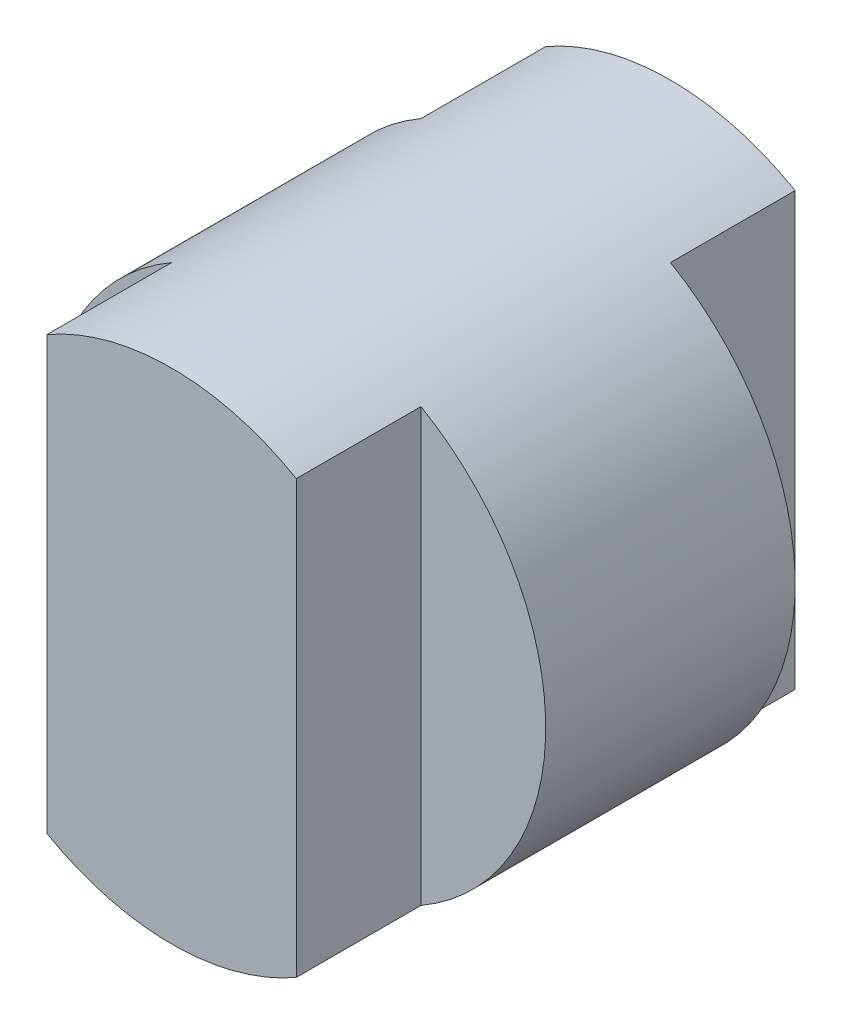
ISO-10303-21;
HEADER;
FILE_DESCRIPTION(('STEP AP214'),'2;1');
FILE_NAME('part.step','',(''),(''),'','','');
FILE_SCHEMA(('AUTOMOTIVE_DESIGN { 1 0 10303 214 1 1 1 1 }'));
ENDSEC;
DATA;
#1=APPLICATION_CONTEXT('core data for automotive mechanical design processes');
#2=APPLICATION_PROTOCOL_DEFINITION('international standard','automotive_design',2000,#1);
#3=PRODUCT_CONTEXT('',#1,'mechanical');
#4=PRODUCT('Part','Part','',(#3));
#5=PRODUCT_RELATED_PRODUCT_CATEGORY('part','',(#4));
#6=PRODUCT_DEFINITION_FORMATION('','',#4);
#7=PRODUCT_DEFINITION_CONTEXT('part definition',#1,'design');
#8=PRODUCT_DEFINITION('design','',#6,#7);
#9=PRODUCT_DEFINITION_SHAPE('','',#8);
#10=(LENGTH_UNIT() NAMED_UNIT(*) SI_UNIT(.MILLI.,.METRE.));
#11=(NAMED_UNIT(*) PLANE_ANGLE_UNIT() SI_UNIT($,.RADIAN.));
#12=(NAMED_UNIT(*) SI_UNIT($,.STERADIAN.) SOLID_ANGLE_UNIT());
#13=UNCERTAINTY_MEASURE_WITH_UNIT(LENGTH_MEASURE(1.E-05),#10,'distance_accuracy_value','');
#14=(GEOMETRIC_REPRESENTATION_CONTEXT(3) GLOBAL_UNCERTAINTY_ASSIGNED_CONTEXT((#13)) GLOBAL_UNIT_ASSIGNED_CONTEXT((#10,
#11,#12)) REPRESENTATION_CONTEXT('',''));
#15=CARTESIAN_POINT('',(0.,0.,0.));
#16=DIRECTION('',(0.,0.,1.));
#17=DIRECTION('',(1.,0.,0.));
#18=AXIS2_PLACEMENT_3D('',#15,#16,#17);
#19=CARTESIAN_POINT('',(0.,0.,4.));
#20=DIRECTION('',(0.,0.,-1.));
#21=DIRECTION('',(-1.,0.,0.));
#22=AXIS2_PLACEMENT_3D('',#19,#20,#21);
#23=CYLINDRICAL_SURFACE('',#22,2.);
#24=CARTESIAN_POINT('',(0.,0.,4.));
#25=DIRECTION('',(0.,0.,1.));
#26=DIRECTION('',(1.,0.,0.));
#27=AXIS2_PLACEMENT_3D('',#24,#25,#26);
#28=CIRCLE('',#27,2.);
#29=CARTESIAN_POINT('',(-1.,-1.73205080756888,4.));
#30=VERTEX_POINT('',#29);
#31=CARTESIAN_POINT('',(1.,-1.73205080756888,4.));
#32=VERTEX_POINT('',#31);
#33=EDGE_CURVE('E116',#30,#32,#28,.T.);
#34=ORIENTED_EDGE('',*,*,#33,.F.);
#35=DIRECTION('',(0.,0.,-1.));
#36=VECTOR('',#35,1.);
#37=CARTESIAN_POINT('',(-1.,-1.73205080756888,4.));
#38=LINE('',#37,#36);
#39=CARTESIAN_POINT('',(-1.,-1.73205080756888,3.));
#40=VERTEX_POINT('',#39);
#41=EDGE_CURVE('E55',#30,#40,#38,.T.);
#42=ORIENTED_EDGE('',*,*,#41,.T.);
#43=CARTESIAN_POINT('',(0.,0.,3.));
#44=DIRECTION('',(0.,0.,-1.));
#45=DIRECTION('',(-1.,0.,0.));
#46=AXIS2_PLACEMENT_3D('',#43,#44,#45);
#47=CIRCLE('',#46,2.);
#48=CARTESIAN_POINT('',(-1.,1.73205080756888,3.));
#49=VERTEX_POINT('',#48);
#50=EDGE_CURVE('E130',#40,#49,#47,.T.);
#51=ORIENTED_EDGE('',*,*,#50,.T.);
#52=DIRECTION('',(0.,0.,-1.));
#53=VECTOR('',#52,1.);
#54=CARTESIAN_POINT('',(-1.,1.73205080756888,4.));
#55=LINE('',#54,#53);
#56=CARTESIAN_POINT('',(-1.,1.73205080756888,4.));
#57=VERTEX_POINT('',#56);
#58=EDGE_CURVE('E117',#49,#57,#55,.F.);
#59=ORIENTED_EDGE('',*,*,#58,.T.);
#60=CARTESIAN_POINT('',(1.,1.73205080756888,4.));
#61=VERTEX_POINT('',#60);
#62=EDGE_CURVE('E121',#61,#57,#28,.T.);
#63=ORIENTED_EDGE('',*,*,#62,.F.);
#64=DIRECTION('',(0.,0.,-1.));
#65=VECTOR('',#64,1.);
#66=CARTESIAN_POINT('',(1.,1.73205080756888,4.));
#67=LINE('',#66,#65);
#68=CARTESIAN_POINT('',(1.,1.73205080756888,3.));
#69=VERTEX_POINT('',#68);
#70=EDGE_CURVE('E157',#61,#69,#67,.T.);
#71=ORIENTED_EDGE('',*,*,#70,.T.);
#72=CARTESIAN_POINT('',(0.,0.,3.));
#73=DIRECTION('',(0.,0.,-1.));
#74=DIRECTION('',(-1.,0.,0.));
#75=AXIS2_PLACEMENT_3D('',#72,#73,#74);
#76=CIRCLE('',#75,2.);
#77=CARTESIAN_POINT('',(1.,-1.73205080756888,3.));
#78=VERTEX_POINT('',#77);
#79=EDGE_CURVE('E127',#69,#78,#76,.T.);
#80=ORIENTED_EDGE('',*,*,#79,.T.);
#81=DIRECTION('',(0.,0.,-1.));
#82=VECTOR('',#81,1.);
#83=CARTESIAN_POINT('',(1.,-1.73205080756888,4.));
#84=LINE('',#83,#82);
#85=EDGE_CURVE('E154',#78,#32,#84,.F.);
#86=ORIENTED_EDGE('',*,*,#85,.T.);
#87=EDGE_LOOP('',(#34,#42,#51,#59,#63,#71,#80,#86));
#88=FACE_BOUND('',#87,.T.);
#89=CARTESIAN_POINT('',(0.,0.,1.));
#90=DIRECTION('',(0.,0.,1.));
#91=DIRECTION('',(1.,0.,0.));
#92=AXIS2_PLACEMENT_3D('',#89,#90,#91);
#93=CIRCLE('',#92,2.);
#94=CARTESIAN_POINT('',(1.,-1.73205080756888,1.));
#95=VERTEX_POINT('',#94);
#96=CARTESIAN_POINT('',(1.,1.73205080756888,1.));
#97=VERTEX_POINT('',#96);
#98=EDGE_CURVE('E11',#95,#97,#93,.T.);
#99=ORIENTED_EDGE('',*,*,#98,.T.);
#100=DIRECTION('',(0.,0.,-1.));
#101=VECTOR('',#100,1.);
#102=CARTESIAN_POINT('',(1.,1.73205080756888,4.));
#103=LINE('',#102,#101);
#104=CARTESIAN_POINT('',(1.,1.73205080756888,0.));
#105=VERTEX_POINT('',#104);
#106=EDGE_CURVE('E98',#97,#105,#103,.T.);
#107=ORIENTED_EDGE('',*,*,#106,.T.);
#108=CARTESIAN_POINT('',(0.,0.,0.));
#109=DIRECTION('',(0.,0.,1.));
#110=DIRECTION('',(1.,0.,0.));
#111=AXIS2_PLACEMENT_3D('',#108,#109,#110);
#112=CIRCLE('',#111,2.);
#113=CARTESIAN_POINT('',(-1.,1.73205080756888,0.));
#114=VERTEX_POINT('',#113);
#115=EDGE_CURVE('E107',#105,#114,#112,.T.);
#116=ORIENTED_EDGE('',*,*,#115,.T.);
#117=DIRECTION('',(0.,0.,-1.));
#118=VECTOR('',#117,1.);
#119=CARTESIAN_POINT('',(-1.,1.73205080756888,4.));
#120=LINE('',#119,#118);
#121=CARTESIAN_POINT('',(-1.,1.73205080756888,1.));
#122=VERTEX_POINT('',#121);
#123=EDGE_CURVE('E136',#114,#122,#120,.F.);
#124=ORIENTED_EDGE('',*,*,#123,.T.);
#125=CARTESIAN_POINT('',(0.,0.,1.));
#126=DIRECTION('',(0.,0.,1.));
#127=DIRECTION('',(1.,0.,0.));
#128=AXIS2_PLACEMENT_3D('',#125,#126,#127);
#129=CIRCLE('',#128,2.);
#130=CARTESIAN_POINT('',(-1.,-1.73205080756888,1.));
#131=VERTEX_POINT('',#130);
#132=EDGE_CURVE('E104',#122,#131,#129,.T.);
#133=ORIENTED_EDGE('',*,*,#132,.T.);
#134=DIRECTION('',(0.,0.,-1.));
#135=VECTOR('',#134,1.);
#136=CARTESIAN_POINT('',(-1.,-1.73205080756888,4.));
#137=LINE('',#136,#135);
#138=CARTESIAN_POINT('',(-1.,-1.73205080756888,0.));
#139=VERTEX_POINT('',#138);
#140=EDGE_CURVE('E135',#131,#139,#137,.T.);
#141=ORIENTED_EDGE('',*,*,#140,.T.);
#142=CARTESIAN_POINT('',(1.,-1.73205080756888,0.));
#143=VERTEX_POINT('',#142);
#144=EDGE_CURVE('E114',#139,#143,#112,.T.);
#145=ORIENTED_EDGE('',*,*,#144,.T.);
#146=DIRECTION('',(0.,0.,-1.));
#147=VECTOR('',#146,1.);
#148=CARTESIAN_POINT('',(1.,-1.73205080756888,4.));
#149=LINE('',#148,#147);
#150=EDGE_CURVE('E47',#143,#95,#149,.F.);
#151=ORIENTED_EDGE('',*,*,#150,.T.);
#152=EDGE_LOOP('',(#99,#107,#116,#124,#133,#141,#145,#151));
#153=FACE_BOUND('',#152,.T.);
#154=ADVANCED_FACE('F33',(#88,#153),#23,.T.);
#155=CARTESIAN_POINT('',(0.,0.,4.));
#156=DIRECTION('',(0.,0.,1.));
#157=DIRECTION('',(1.,0.,0.));
#158=AXIS2_PLACEMENT_3D('',#155,#156,#157);
#159=PLANE('',#158);
#160=DIRECTION('',(0.,1.,0.));
#161=VECTOR('',#160,1.);
#162=CARTESIAN_POINT('',(-1.,0.,4.));
#163=LINE('',#162,#161);
#164=EDGE_CURVE('E125',#30,#57,#163,.T.);
#165=ORIENTED_EDGE('',*,*,#164,.F.);
#166=ORIENTED_EDGE('',*,*,#33,.T.);
#167=DIRECTION('',(0.,-1.,0.));
#168=VECTOR('',#167,1.);
#169=CARTESIAN_POINT('',(1.,0.,4.));
#170=LINE('',#169,#168);
#171=EDGE_CURVE('E123',#61,#32,#170,.T.);
#172=ORIENTED_EDGE('',*,*,#171,.F.);
#173=ORIENTED_EDGE('',*,*,#62,.T.);
#174=EDGE_LOOP('',(#165,#166,#172,#173));
#175=FACE_BOUND('',#174,.T.);
#176=ADVANCED_FACE('F167',(#175),#159,.T.);
#177=CARTESIAN_POINT('',(0.,0.,0.));
#178=DIRECTION('',(0.,0.,1.));
#179=DIRECTION('',(1.,0.,0.));
#180=AXIS2_PLACEMENT_3D('',#177,#178,#179);
#181=PLANE('',#180);
#182=ORIENTED_EDGE('',*,*,#115,.F.);
#183=DIRECTION('',(0.,-1.,0.));
#184=VECTOR('',#183,1.);
#185=CARTESIAN_POINT('',(1.,0.,0.));
#186=LINE('',#185,#184);
#187=EDGE_CURVE('E40',#105,#143,#186,.T.);
#188=ORIENTED_EDGE('',*,*,#187,.T.);
#189=ORIENTED_EDGE('',*,*,#144,.F.);
#190=DIRECTION('',(0.,1.,0.));
#191=VECTOR('',#190,1.);
#192=CARTESIAN_POINT('',(-1.,0.,0.));
#193=LINE('',#192,#191);
#194=EDGE_CURVE('E113',#139,#114,#193,.T.);
#195=ORIENTED_EDGE('',*,*,#194,.T.);
#196=EDGE_LOOP('',(#182,#188,#189,#195));
#197=FACE_BOUND('',#196,.T.);
#198=ADVANCED_FACE('F112',(#197),#181,.F.);
#199=CARTESIAN_POINT('',(-1.,-5.,1.));
#200=DIRECTION('',(1.,0.,0.));
#201=DIRECTION('',(0.,0.,-1.));
#202=AXIS2_PLACEMENT_3D('',#199,#200,#201);
#203=PLANE('',#202);
#204=DIRECTION('',(0.,1.,0.));
#205=VECTOR('',#204,1.);
#206=CARTESIAN_POINT('',(-1.,-5.,1.));
#207=LINE('',#206,#205);
#208=EDGE_CURVE('E141',#131,#122,#207,.T.);
#209=ORIENTED_EDGE('',*,*,#208,.T.);
#210=ORIENTED_EDGE('',*,*,#123,.F.);
#211=ORIENTED_EDGE('',*,*,#194,.F.);
#212=ORIENTED_EDGE('',*,*,#140,.F.);
#213=EDGE_LOOP('',(#209,#210,#211,#212));
#214=FACE_BOUND('',#213,.T.);
#215=ADVANCED_FACE('F143',(#214),#203,.F.);
#216=CARTESIAN_POINT('',(-2.31386891999832,-5.,1.));
#217=DIRECTION('',(0.,0.,1.));
#218=DIRECTION('',(1.,0.,0.));
#219=AXIS2_PLACEMENT_3D('',#216,#217,#218);
#220=PLANE('',#219);
#221=ORIENTED_EDGE('',*,*,#208,.F.);
#222=ORIENTED_EDGE('',*,*,#132,.F.);
#223=EDGE_LOOP('',(#221,#222));
#224=FACE_BOUND('',#223,.T.);
#225=ADVANCED_FACE('F140',(#224),#220,.F.);
#226=CARTESIAN_POINT('',(1.,-5.,3.));
#227=DIRECTION('',(-1.,0.,0.));
#228=DIRECTION('',(0.,0.,1.));
#229=AXIS2_PLACEMENT_3D('',#226,#227,#228);
#230=PLANE('',#229);
#231=ORIENTED_EDGE('',*,*,#171,.T.);
#232=ORIENTED_EDGE('',*,*,#85,.F.);
#233=DIRECTION('',(0.,1.,0.));
#234=VECTOR('',#233,1.);
#235=CARTESIAN_POINT('',(1.,-5.,3.));
#236=LINE('',#235,#234);
#237=EDGE_CURVE('E109',#78,#69,#236,.T.);
#238=ORIENTED_EDGE('',*,*,#237,.T.);
#239=ORIENTED_EDGE('',*,*,#70,.F.);
#240=EDGE_LOOP('',(#231,#232,#238,#239));
#241=FACE_BOUND('',#240,.T.);
#242=ADVANCED_FACE('F171',(#241),#230,.F.);
#243=CARTESIAN_POINT('',(2.,-5.,3.));
#244=DIRECTION('',(0.,0.,-1.));
#245=DIRECTION('',(-1.,0.,0.));
#246=AXIS2_PLACEMENT_3D('',#243,#244,#245);
#247=PLANE('',#246);
#248=ORIENTED_EDGE('',*,*,#237,.F.);
#249=ORIENTED_EDGE('',*,*,#79,.F.);
#250=EDGE_LOOP('',(#248,#249));
#251=FACE_BOUND('',#250,.T.);
#252=ADVANCED_FACE('F173',(#251),#247,.F.);
#253=CARTESIAN_POINT('',(-1.,-5.,3.));
#254=DIRECTION('',(0.,0.,-1.));
#255=DIRECTION('',(-1.,0.,0.));
#256=AXIS2_PLACEMENT_3D('',#253,#254,#255);
#257=PLANE('',#256);
#258=DIRECTION('',(0.,1.,0.));
#259=VECTOR('',#258,1.);
#260=CARTESIAN_POINT('',(-1.,-5.,3.));
#261=LINE('',#260,#259);
#262=EDGE_CURVE('E144',#40,#49,#261,.T.);
#263=ORIENTED_EDGE('',*,*,#262,.T.);
#264=ORIENTED_EDGE('',*,*,#50,.F.);
#265=EDGE_LOOP('',(#263,#264));
#266=FACE_BOUND('',#265,.T.);
#267=ADVANCED_FACE('F175',(#266),#257,.F.);
#268=CARTESIAN_POINT('',(-1.,-5.,4.26455627023164));
#269=DIRECTION('',(1.,0.,0.));
#270=DIRECTION('',(0.,0.,-1.));
#271=AXIS2_PLACEMENT_3D('',#268,#269,#270);
#272=PLANE('',#271);
#273=ORIENTED_EDGE('',*,*,#164,.T.);
#274=ORIENTED_EDGE('',*,*,#58,.F.);
#275=ORIENTED_EDGE('',*,*,#262,.F.);
#276=ORIENTED_EDGE('',*,*,#41,.F.);
#277=EDGE_LOOP('',(#273,#274,#275,#276));
#278=FACE_BOUND('',#277,.T.);
#279=ADVANCED_FACE('F181',(#278),#272,.F.);
#280=CARTESIAN_POINT('',(2.,-5.,1.));
#281=DIRECTION('',(0.,0.,1.));
#282=DIRECTION('',(1.,0.,0.));
#283=AXIS2_PLACEMENT_3D('',#280,#281,#282);
#284=PLANE('',#283);
#285=ORIENTED_EDGE('',*,*,#98,.F.);
#286=DIRECTION('',(0.,1.,0.));
#287=VECTOR('',#286,1.);
#288=CARTESIAN_POINT('',(1.,-5.,1.));
#289=LINE('',#288,#287);
#290=EDGE_CURVE('E213',#95,#97,#289,.T.);
#291=ORIENTED_EDGE('',*,*,#290,.T.);
#292=EDGE_LOOP('',(#285,#291));
#293=FACE_BOUND('',#292,.T.);
#294=ADVANCED_FACE('F207',(#293),#284,.F.);
#295=CARTESIAN_POINT('',(1.,-5.,0.));
#296=DIRECTION('',(-1.,0.,0.));
#297=DIRECTION('',(0.,0.,1.));
#298=AXIS2_PLACEMENT_3D('',#295,#296,#297);
#299=PLANE('',#298);
#300=ORIENTED_EDGE('',*,*,#290,.F.);
#301=ORIENTED_EDGE('',*,*,#150,.F.);
#302=ORIENTED_EDGE('',*,*,#187,.F.);
#303=ORIENTED_EDGE('',*,*,#106,.F.);
#304=EDGE_LOOP('',(#300,#301,#302,#303));
#305=FACE_BOUND('',#304,.T.);
#306=ADVANCED_FACE('F97',(#305),#299,.F.);
#307=CLOSED_SHELL('',(#154,#176,#198,#215,#225,#242,#252,#267,#279,#294,#306));
#308=MANIFOLD_SOLID_BREP('B2',#307);
#309=ADVANCED_BREP_SHAPE_REPRESENTATION('',(#18,#308),#14);
#310=SHAPE_DEFINITION_REPRESENTATION(#9,#309);
ENDSEC;
END-ISO-10303-21;
